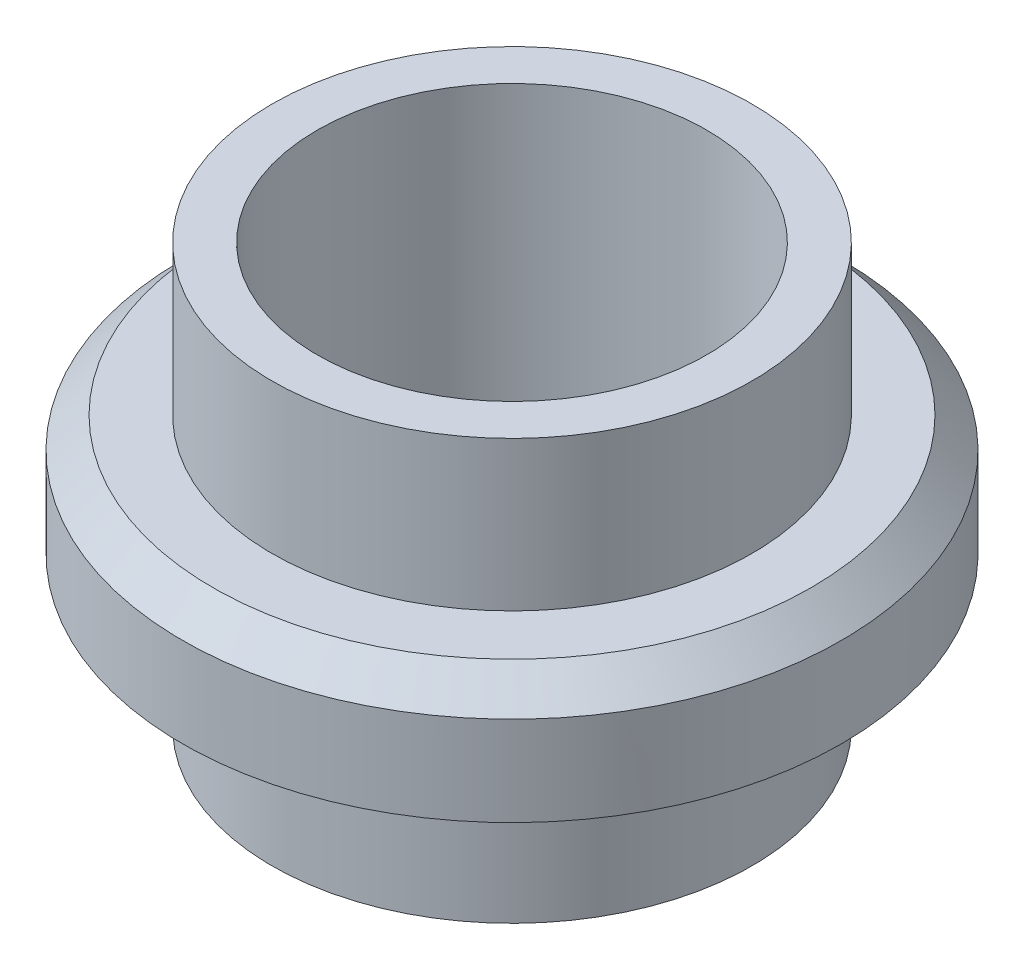
ISO-10303-21;
HEADER;
FILE_DESCRIPTION(('STEP AP214'),'2;1');
FILE_NAME('part.step','',(''),(''),'','','');
FILE_SCHEMA(('AUTOMOTIVE_DESIGN { 1 0 10303 214 1 1 1 1 }'));
ENDSEC;
DATA;
#1=APPLICATION_CONTEXT('core data for automotive mechanical design processes');
#2=APPLICATION_PROTOCOL_DEFINITION('international standard','automotive_design',2000,#1);
#3=PRODUCT_CONTEXT('',#1,'mechanical');
#4=PRODUCT('Part','Part','',(#3));
#5=PRODUCT_RELATED_PRODUCT_CATEGORY('part','',(#4));
#6=PRODUCT_DEFINITION_FORMATION('','',#4);
#7=PRODUCT_DEFINITION_CONTEXT('part definition',#1,'design');
#8=PRODUCT_DEFINITION('design','',#6,#7);
#9=PRODUCT_DEFINITION_SHAPE('','',#8);
#10=(LENGTH_UNIT() NAMED_UNIT(*) SI_UNIT(.MILLI.,.METRE.));
#11=(NAMED_UNIT(*) PLANE_ANGLE_UNIT() SI_UNIT($,.RADIAN.));
#12=(NAMED_UNIT(*) SI_UNIT($,.STERADIAN.) SOLID_ANGLE_UNIT());
#13=UNCERTAINTY_MEASURE_WITH_UNIT(LENGTH_MEASURE(1.E-05),#10,'distance_accuracy_value','');
#14=(GEOMETRIC_REPRESENTATION_CONTEXT(3) GLOBAL_UNCERTAINTY_ASSIGNED_CONTEXT((#13)) GLOBAL_UNIT_ASSIGNED_CONTEXT((#10,
#11,#12)) REPRESENTATION_CONTEXT('',''));
#15=CARTESIAN_POINT('',(0.,0.,0.));
#16=DIRECTION('',(0.,0.,1.));
#17=DIRECTION('',(1.,0.,0.));
#18=AXIS2_PLACEMENT_3D('',#15,#16,#17);
#19=CARTESIAN_POINT('',(0.,3.08817061181163,0.));
#20=DIRECTION('',(0.,-1.,0.));
#21=DIRECTION('',(1.,0.,0.));
#22=AXIS2_PLACEMENT_3D('',#19,#20,#21);
#23=PLANE('',#22);
#24=CARTESIAN_POINT('',(25.714043429226,3.08817061181163,0.));
#25=DIRECTION('',(0.,1.,0.));
#26=DIRECTION('',(-1.,0.,0.));
#27=AXIS2_PLACEMENT_3D('',#24,#25,#26);
#28=CIRCLE('',#27,27.6);
#29=CARTESIAN_POINT('',(-1.88595657077403,3.08817061181162,0.));
#30=VERTEX_POINT('',#29);
#31=EDGE_CURVE('E50',#30,#30,#28,.T.);
#32=ORIENTED_EDGE('',*,*,#31,.T.);
#33=EDGE_LOOP('',(#32));
#34=FACE_BOUND('',#33,.T.);
#35=CARTESIAN_POINT('',(25.714043429226,3.08817061181163,0.));
#36=DIRECTION('',(0.,1.,0.));
#37=DIRECTION('',(-1.,0.,0.));
#38=AXIS2_PLACEMENT_3D('',#35,#36,#37);
#39=CIRCLE('',#38,34.4);
#40=CARTESIAN_POINT('',(-8.685956570774,3.08817061181163,0.));
#41=VERTEX_POINT('',#40);
#42=EDGE_CURVE('E85',#41,#41,#39,.T.);
#43=ORIENTED_EDGE('',*,*,#42,.F.);
#44=EDGE_LOOP('',(#43));
#45=FACE_BOUND('',#44,.T.);
#46=ADVANCED_FACE('F37',(#34,#45),#23,.T.);
#47=CARTESIAN_POINT('',(25.714043429226,25.4720277784783,0.));
#48=DIRECTION('',(0.,1.,0.));
#49=DIRECTION('',(-1.,0.,0.));
#50=AXIS2_PLACEMENT_3D('',#47,#48,#49);
#51=CYLINDRICAL_SURFACE('',#50,27.6);
#52=CARTESIAN_POINT('',(25.714043429226,-22.8279722215217,0.));
#53=DIRECTION('',(0.,1.,0.));
#54=DIRECTION('',(-1.,0.,0.));
#55=AXIS2_PLACEMENT_3D('',#52,#53,#54);
#56=CIRCLE('',#55,27.6);
#57=CARTESIAN_POINT('',(-1.88595657077403,-22.8279722215217,0.));
#58=VERTEX_POINT('',#57);
#59=EDGE_CURVE('E55',#58,#58,#56,.T.);
#60=ORIENTED_EDGE('',*,*,#59,.T.);
#61=EDGE_LOOP('',(#60));
#62=FACE_BOUND('',#61,.T.);
#63=ORIENTED_EDGE('',*,*,#31,.F.);
#64=EDGE_LOOP('',(#63));
#65=FACE_BOUND('',#64,.T.);
#66=ADVANCED_FACE('F93',(#62,#65),#51,.T.);
#67=CARTESIAN_POINT('',(0.,-22.8279722215217,0.));
#68=DIRECTION('',(0.,-1.,0.));
#69=DIRECTION('',(1.,0.,0.));
#70=AXIS2_PLACEMENT_3D('',#67,#68,#69);
#71=PLANE('',#70);
#72=CARTESIAN_POINT('',(25.714043429226,-22.8279722215217,0.));
#73=DIRECTION('',(0.,1.,0.));
#74=DIRECTION('',(-1.,0.,0.));
#75=AXIS2_PLACEMENT_3D('',#72,#73,#74);
#76=CIRCLE('',#75,22.4);
#77=CARTESIAN_POINT('',(3.31404342922598,-22.8279722215217,0.));
#78=VERTEX_POINT('',#77);
#79=EDGE_CURVE('E61',#78,#78,#76,.T.);
#80=ORIENTED_EDGE('',*,*,#79,.T.);
#81=EDGE_LOOP('',(#80));
#82=FACE_BOUND('',#81,.T.);
#83=ORIENTED_EDGE('',*,*,#59,.F.);
#84=EDGE_LOOP('',(#83));
#85=FACE_BOUND('',#84,.T.);
#86=ADVANCED_FACE('F98',(#82,#85),#71,.T.);
#87=CARTESIAN_POINT('',(25.714043429226,25.4720277784783,0.));
#88=DIRECTION('',(0.,1.,0.));
#89=DIRECTION('',(-1.,0.,0.));
#90=AXIS2_PLACEMENT_3D('',#87,#88,#89);
#91=CYLINDRICAL_SURFACE('',#90,22.4);
#92=ORIENTED_EDGE('',*,*,#79,.F.);
#93=EDGE_LOOP('',(#92));
#94=FACE_BOUND('',#93,.T.);
#95=CARTESIAN_POINT('',(25.714043429226,25.4720277784783,0.));
#96=DIRECTION('',(0.,1.,0.));
#97=DIRECTION('',(-1.,0.,0.));
#98=AXIS2_PLACEMENT_3D('',#95,#96,#97);
#99=CIRCLE('',#98,22.4);
#100=CARTESIAN_POINT('',(3.31404342922595,25.4720277784783,0.));
#101=VERTEX_POINT('',#100);
#102=EDGE_CURVE('E65',#101,#101,#99,.T.);
#103=ORIENTED_EDGE('',*,*,#102,.T.);
#104=EDGE_LOOP('',(#103));
#105=FACE_BOUND('',#104,.T.);
#106=ADVANCED_FACE('F104',(#94,#105),#91,.F.);
#107=CARTESIAN_POINT('',(0.,25.4720277784783,0.));
#108=DIRECTION('',(0.,-1.,0.));
#109=DIRECTION('',(1.,0.,0.));
#110=AXIS2_PLACEMENT_3D('',#107,#108,#109);
#111=PLANE('',#110);
#112=ORIENTED_EDGE('',*,*,#102,.F.);
#113=EDGE_LOOP('',(#112));
#114=FACE_BOUND('',#113,.T.);
#115=CARTESIAN_POINT('',(25.714043429226,25.4720277784783,0.));
#116=DIRECTION('',(0.,1.,0.));
#117=DIRECTION('',(-1.,0.,0.));
#118=AXIS2_PLACEMENT_3D('',#115,#116,#117);
#119=CIRCLE('',#118,27.5999999999999);
#120=CARTESIAN_POINT('',(-1.88595657077398,25.4720277784783,0.));
#121=VERTEX_POINT('',#120);
#122=EDGE_CURVE('E69',#121,#121,#119,.T.);
#123=ORIENTED_EDGE('',*,*,#122,.T.);
#124=EDGE_LOOP('',(#123));
#125=FACE_BOUND('',#124,.T.);
#126=ADVANCED_FACE('F108',(#114,#125),#111,.F.);
#127=CARTESIAN_POINT('',(25.714043429226,25.4720277784783,0.));
#128=DIRECTION('',(0.,1.,0.));
#129=DIRECTION('',(-1.,0.,0.));
#130=AXIS2_PLACEMENT_3D('',#127,#128,#129);
#131=CYLINDRICAL_SURFACE('',#130,27.6);
#132=CARTESIAN_POINT('',(25.714043429226,8.28817061181162,0.));
#133=DIRECTION('',(0.,1.,0.));
#134=DIRECTION('',(-1.,0.,0.));
#135=AXIS2_PLACEMENT_3D('',#132,#133,#134);
#136=CIRCLE('',#135,27.6);
#137=CARTESIAN_POINT('',(-1.88595657077403,8.28817061181162,0.));
#138=VERTEX_POINT('',#137);
#139=EDGE_CURVE('E73',#138,#138,#136,.T.);
#140=ORIENTED_EDGE('',*,*,#139,.T.);
#141=EDGE_LOOP('',(#140));
#142=FACE_BOUND('',#141,.T.);
#143=ORIENTED_EDGE('',*,*,#122,.F.);
#144=EDGE_LOOP('',(#143));
#145=FACE_BOUND('',#144,.T.);
#146=ADVANCED_FACE('F112',(#142,#145),#131,.T.);
#147=CARTESIAN_POINT('',(0.,8.28817061181162,0.));
#148=DIRECTION('',(0.,-1.,0.));
#149=DIRECTION('',(1.,0.,0.));
#150=AXIS2_PLACEMENT_3D('',#147,#148,#149);
#151=PLANE('',#150);
#152=CARTESIAN_POINT('',(25.714043429226,8.28817061181163,0.));
#153=DIRECTION('',(0.,-1.,0.));
#154=DIRECTION('',(1.,0.,0.));
#155=AXIS2_PLACEMENT_3D('',#152,#153,#154);
#156=CIRCLE('',#155,34.4);
#157=CARTESIAN_POINT('',(60.114043429226,8.28817061181163,0.));
#158=VERTEX_POINT('',#157);
#159=EDGE_CURVE('E45',#158,#158,#156,.F.);
#160=ORIENTED_EDGE('',*,*,#159,.T.);
#161=EDGE_LOOP('',(#160));
#162=FACE_BOUND('',#161,.T.);
#163=ORIENTED_EDGE('',*,*,#139,.F.);
#164=EDGE_LOOP('',(#163));
#165=FACE_BOUND('',#164,.T.);
#166=ADVANCED_FACE('F116',(#162,#165),#151,.F.);
#167=CARTESIAN_POINT('',(25.714043429226,25.4720277784783,0.));
#168=DIRECTION('',(0.,1.,0.));
#169=DIRECTION('',(-1.,0.,0.));
#170=AXIS2_PLACEMENT_3D('',#167,#168,#169);
#171=CYLINDRICAL_SURFACE('',#170,37.9);
#172=CARTESIAN_POINT('',(25.714043429226,4.78817061181159,0.));
#173=DIRECTION('',(0.,-1.,0.));
#174=DIRECTION('',(0.,0.,-1.));
#175=AXIS2_PLACEMENT_3D('',#172,#173,#174);
#176=CIRCLE('',#175,37.9);
#177=CARTESIAN_POINT('',(25.714043429226,4.78817061181159,-37.9));
#178=VERTEX_POINT('',#177);
#179=EDGE_CURVE('E10',#178,#178,#176,.T.);
#180=ORIENTED_EDGE('',*,*,#179,.T.);
#181=EDGE_LOOP('',(#180));
#182=FACE_BOUND('',#181,.T.);
#183=CARTESIAN_POINT('',(25.714043429226,-5.51182938818837,0.));
#184=DIRECTION('',(0.,1.,0.));
#185=DIRECTION('',(-1.,0.,0.));
#186=AXIS2_PLACEMENT_3D('',#183,#184,#185);
#187=CIRCLE('',#186,37.9);
#188=CARTESIAN_POINT('',(-12.185956570774,-5.51182938818837,0.));
#189=VERTEX_POINT('',#188);
#190=EDGE_CURVE('E77',#189,#189,#187,.T.);
#191=ORIENTED_EDGE('',*,*,#190,.T.);
#192=EDGE_LOOP('',(#191));
#193=FACE_BOUND('',#192,.T.);
#194=ADVANCED_FACE('F120',(#182,#193),#171,.T.);
#195=CARTESIAN_POINT('',(0.,-5.51182938818837,0.));
#196=DIRECTION('',(0.,-1.,0.));
#197=DIRECTION('',(1.,0.,0.));
#198=AXIS2_PLACEMENT_3D('',#195,#196,#197);
#199=PLANE('',#198);
#200=CARTESIAN_POINT('',(25.714043429226,-5.51182938818837,0.));
#201=DIRECTION('',(0.,1.,0.));
#202=DIRECTION('',(-1.,0.,0.));
#203=AXIS2_PLACEMENT_3D('',#200,#201,#202);
#204=CIRCLE('',#203,34.4);
#205=CARTESIAN_POINT('',(-8.68595657077401,-5.51182938818838,0.));
#206=VERTEX_POINT('',#205);
#207=EDGE_CURVE('E81',#206,#206,#204,.T.);
#208=ORIENTED_EDGE('',*,*,#207,.T.);
#209=EDGE_LOOP('',(#208));
#210=FACE_BOUND('',#209,.T.);
#211=ORIENTED_EDGE('',*,*,#190,.F.);
#212=EDGE_LOOP('',(#211));
#213=FACE_BOUND('',#212,.T.);
#214=ADVANCED_FACE('F123',(#210,#213),#199,.T.);
#215=CARTESIAN_POINT('',(25.714043429226,25.4720277784783,0.));
#216=DIRECTION('',(0.,1.,0.));
#217=DIRECTION('',(-1.,0.,0.));
#218=AXIS2_PLACEMENT_3D('',#215,#216,#217);
#219=CYLINDRICAL_SURFACE('',#218,34.4);
#220=ORIENTED_EDGE('',*,*,#207,.F.);
#221=EDGE_LOOP('',(#220));
#222=FACE_BOUND('',#221,.T.);
#223=ORIENTED_EDGE('',*,*,#42,.T.);
#224=EDGE_LOOP('',(#223));
#225=FACE_BOUND('',#224,.T.);
#226=ADVANCED_FACE('F90',(#222,#225),#219,.F.);
#227=CARTESIAN_POINT('',(25.714043429226,8.28817061181163,0.));
#228=DIRECTION('',(0.,-1.,0.));
#229=DIRECTION('',(0.,0.,-1.));
#230=AXIS2_PLACEMENT_3D('',#227,#228,#229);
#231=CONICAL_SURFACE('',#230,34.4,0.785398163397445);
#232=ORIENTED_EDGE('',*,*,#179,.F.);
#233=EDGE_LOOP('',(#232));
#234=FACE_BOUND('',#233,.T.);
#235=ORIENTED_EDGE('',*,*,#159,.F.);
#236=EDGE_LOOP('',(#235));
#237=FACE_BOUND('',#236,.T.);
#238=ADVANCED_FACE('F39',(#234,#237),#231,.T.);
#239=CLOSED_SHELL('',(#46,#66,#86,#106,#126,#146,#166,#194,#214,#226,#238));
#240=MANIFOLD_SOLID_BREP('B2',#239);
#241=ADVANCED_BREP_SHAPE_REPRESENTATION('',(#18,#240),#14);
#242=SHAPE_DEFINITION_REPRESENTATION(#9,#241);
ENDSEC;
END-ISO-10303-21;
